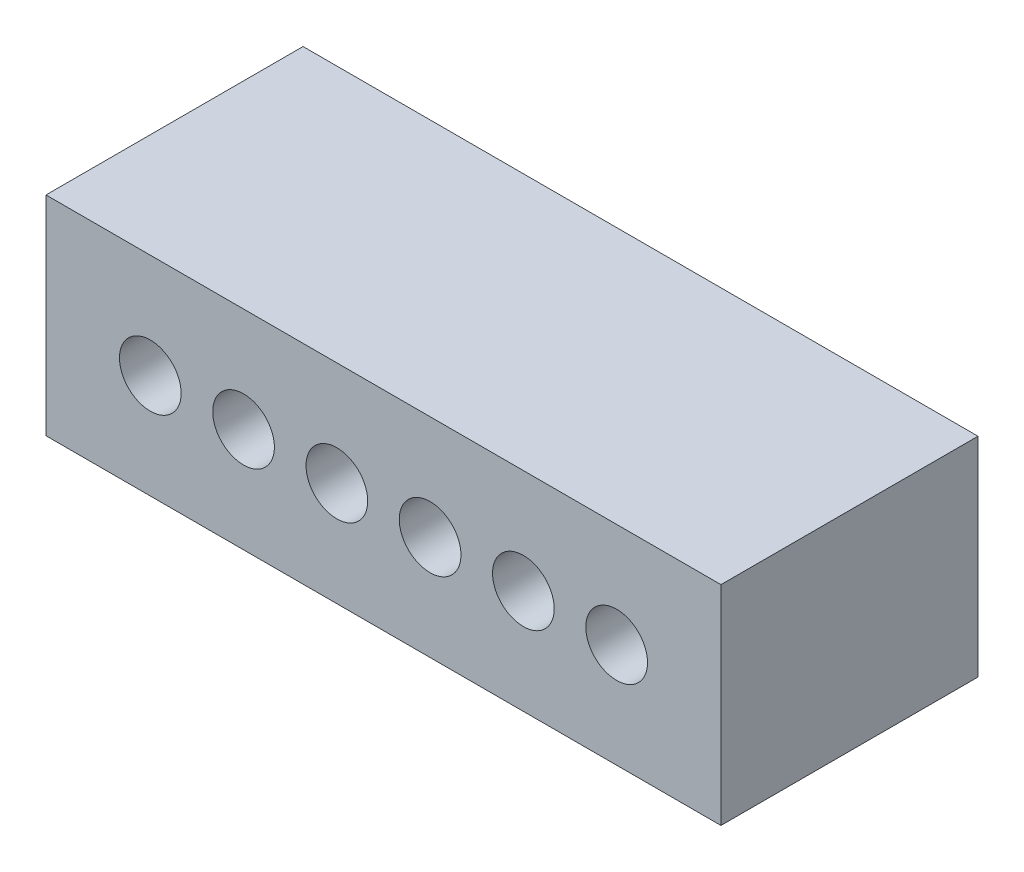
ISO-10303-21;
HEADER;
FILE_DESCRIPTION(('STEP AP214'),'2;1');
FILE_NAME('part.step','',(''),(''),'','','');
FILE_SCHEMA(('AUTOMOTIVE_DESIGN { 1 0 10303 214 1 1 1 1 }'));
ENDSEC;
DATA;
#1=APPLICATION_CONTEXT('core data for automotive mechanical design processes');
#2=APPLICATION_PROTOCOL_DEFINITION('international standard','automotive_design',2000,#1);
#3=PRODUCT_CONTEXT('',#1,'mechanical');
#4=PRODUCT('Part','Part','',(#3));
#5=PRODUCT_RELATED_PRODUCT_CATEGORY('part','',(#4));
#6=PRODUCT_DEFINITION_FORMATION('','',#4);
#7=PRODUCT_DEFINITION_CONTEXT('part definition',#1,'design');
#8=PRODUCT_DEFINITION('design','',#6,#7);
#9=PRODUCT_DEFINITION_SHAPE('','',#8);
#10=(LENGTH_UNIT() NAMED_UNIT(*) SI_UNIT(.MILLI.,.METRE.));
#11=(NAMED_UNIT(*) PLANE_ANGLE_UNIT() SI_UNIT($,.RADIAN.));
#12=(NAMED_UNIT(*) SI_UNIT($,.STERADIAN.) SOLID_ANGLE_UNIT());
#13=UNCERTAINTY_MEASURE_WITH_UNIT(LENGTH_MEASURE(1.E-05),#10,'distance_accuracy_value','');
#14=(GEOMETRIC_REPRESENTATION_CONTEXT(3) GLOBAL_UNCERTAINTY_ASSIGNED_CONTEXT((#13)) GLOBAL_UNIT_ASSIGNED_CONTEXT((#10,
#11,#12)) REPRESENTATION_CONTEXT('',''));
#15=CARTESIAN_POINT('',(0.,0.,0.));
#16=DIRECTION('',(0.,0.,1.));
#17=DIRECTION('',(1.,0.,0.));
#18=AXIS2_PLACEMENT_3D('',#15,#16,#17);
#19=CARTESIAN_POINT('',(0.,0.,7.));
#20=DIRECTION('',(0.,0.,-1.));
#21=DIRECTION('',(-1.,0.,0.));
#22=AXIS2_PLACEMENT_3D('',#19,#20,#21);
#23=PLANE('',#22);
#24=DIRECTION('',(0.,1.,0.));
#25=VECTOR('',#24,1.);
#26=CARTESIAN_POINT('',(9.19,-2.84,7.));
#27=LINE('',#26,#25);
#28=CARTESIAN_POINT('',(9.19,-2.84,7.));
#29=VERTEX_POINT('',#28);
#30=CARTESIAN_POINT('',(9.19,2.84,7.));
#31=VERTEX_POINT('',#30);
#32=EDGE_CURVE('E89',#29,#31,#27,.T.);
#33=ORIENTED_EDGE('',*,*,#32,.T.);
#34=DIRECTION('',(-1.,0.,0.));
#35=VECTOR('',#34,1.);
#36=CARTESIAN_POINT('',(-9.19,2.84,7.));
#37=LINE('',#36,#35);
#38=CARTESIAN_POINT('',(-9.19,2.84,7.));
#39=VERTEX_POINT('',#38);
#40=EDGE_CURVE('E84',#31,#39,#37,.T.);
#41=ORIENTED_EDGE('',*,*,#40,.T.);
#42=DIRECTION('',(0.,-1.,0.));
#43=VECTOR('',#42,1.);
#44=CARTESIAN_POINT('',(-9.19,-2.84,7.));
#45=LINE('',#44,#43);
#46=CARTESIAN_POINT('',(-9.19,-2.84,7.));
#47=VERTEX_POINT('',#46);
#48=EDGE_CURVE('E87',#39,#47,#45,.T.);
#49=ORIENTED_EDGE('',*,*,#48,.T.);
#50=DIRECTION('',(1.,0.,0.));
#51=VECTOR('',#50,1.);
#52=CARTESIAN_POINT('',(-9.19,-2.84,7.));
#53=LINE('',#52,#51);
#54=EDGE_CURVE('E54',#47,#29,#53,.T.);
#55=ORIENTED_EDGE('',*,*,#54,.T.);
#56=EDGE_LOOP('',(#33,#41,#49,#55));
#57=FACE_BOUND('',#56,.T.);
#58=CARTESIAN_POINT('',(-6.35,0.,7.));
#59=DIRECTION('',(0.,0.,1.));
#60=DIRECTION('',(1.,0.,0.));
#61=AXIS2_PLACEMENT_3D('',#58,#59,#60);
#62=CIRCLE('',#61,0.84);
#63=CARTESIAN_POINT('',(-5.51,0.,7.));
#64=VERTEX_POINT('',#63);
#65=EDGE_CURVE('E104',#64,#64,#62,.T.);
#66=ORIENTED_EDGE('',*,*,#65,.F.);
#67=EDGE_LOOP('',(#66));
#68=FACE_BOUND('',#67,.T.);
#69=CARTESIAN_POINT('',(-3.81,0.,7.));
#70=DIRECTION('',(0.,0.,1.));
#71=DIRECTION('',(1.,0.,0.));
#72=AXIS2_PLACEMENT_3D('',#69,#70,#71);
#73=CIRCLE('',#72,0.84);
#74=CARTESIAN_POINT('',(-2.97,0.,7.));
#75=VERTEX_POINT('',#74);
#76=EDGE_CURVE('E119',#75,#75,#73,.T.);
#77=ORIENTED_EDGE('',*,*,#76,.F.);
#78=EDGE_LOOP('',(#77));
#79=FACE_BOUND('',#78,.T.);
#80=CARTESIAN_POINT('',(-1.27,0.,7.));
#81=DIRECTION('',(0.,0.,1.));
#82=DIRECTION('',(1.,0.,0.));
#83=AXIS2_PLACEMENT_3D('',#80,#81,#82);
#84=CIRCLE('',#83,0.84);
#85=CARTESIAN_POINT('',(-0.43,0.,7.));
#86=VERTEX_POINT('',#85);
#87=EDGE_CURVE('E125',#86,#86,#84,.T.);
#88=ORIENTED_EDGE('',*,*,#87,.F.);
#89=EDGE_LOOP('',(#88));
#90=FACE_BOUND('',#89,.T.);
#91=CARTESIAN_POINT('',(1.27,0.,7.));
#92=DIRECTION('',(0.,0.,1.));
#93=DIRECTION('',(1.,0.,0.));
#94=AXIS2_PLACEMENT_3D('',#91,#92,#93);
#95=CIRCLE('',#94,0.84);
#96=CARTESIAN_POINT('',(2.11,0.,7.));
#97=VERTEX_POINT('',#96);
#98=EDGE_CURVE('E131',#97,#97,#95,.T.);
#99=ORIENTED_EDGE('',*,*,#98,.F.);
#100=EDGE_LOOP('',(#99));
#101=FACE_BOUND('',#100,.T.);
#102=CARTESIAN_POINT('',(3.81,0.,7.));
#103=DIRECTION('',(0.,0.,1.));
#104=DIRECTION('',(1.,0.,0.));
#105=AXIS2_PLACEMENT_3D('',#102,#103,#104);
#106=CIRCLE('',#105,0.84);
#107=CARTESIAN_POINT('',(4.65,0.,7.));
#108=VERTEX_POINT('',#107);
#109=EDGE_CURVE('E137',#108,#108,#106,.T.);
#110=ORIENTED_EDGE('',*,*,#109,.F.);
#111=EDGE_LOOP('',(#110));
#112=FACE_BOUND('',#111,.T.);
#113=CARTESIAN_POINT('',(6.35,0.,7.));
#114=DIRECTION('',(0.,0.,1.));
#115=DIRECTION('',(1.,0.,0.));
#116=AXIS2_PLACEMENT_3D('',#113,#114,#115);
#117=CIRCLE('',#116,0.84);
#118=CARTESIAN_POINT('',(7.19,0.,7.));
#119=VERTEX_POINT('',#118);
#120=EDGE_CURVE('E143',#119,#119,#117,.T.);
#121=ORIENTED_EDGE('',*,*,#120,.F.);
#122=EDGE_LOOP('',(#121));
#123=FACE_BOUND('',#122,.T.);
#124=ADVANCED_FACE('F37',(#57,#68,#79,#90,#101,#112,#123),#23,.F.);
#125=CARTESIAN_POINT('',(0.,0.,0.));
#126=DIRECTION('',(0.,0.,-1.));
#127=DIRECTION('',(-1.,0.,0.));
#128=AXIS2_PLACEMENT_3D('',#125,#126,#127);
#129=PLANE('',#128);
#130=CARTESIAN_POINT('',(3.81,0.,0.));
#131=DIRECTION('',(0.,0.,1.));
#132=DIRECTION('',(1.,0.,0.));
#133=AXIS2_PLACEMENT_3D('',#130,#131,#132);
#134=CIRCLE('',#133,0.84);
#135=CARTESIAN_POINT('',(4.65,0.,0.));
#136=VERTEX_POINT('',#135);
#137=EDGE_CURVE('E140',#136,#136,#134,.T.);
#138=ORIENTED_EDGE('',*,*,#137,.T.);
#139=EDGE_LOOP('',(#138));
#140=FACE_BOUND('',#139,.T.);
#141=CARTESIAN_POINT('',(-1.27,0.,0.));
#142=DIRECTION('',(0.,0.,1.));
#143=DIRECTION('',(1.,0.,0.));
#144=AXIS2_PLACEMENT_3D('',#141,#142,#143);
#145=CIRCLE('',#144,0.84);
#146=CARTESIAN_POINT('',(-0.43,0.,0.));
#147=VERTEX_POINT('',#146);
#148=EDGE_CURVE('E128',#147,#147,#145,.T.);
#149=ORIENTED_EDGE('',*,*,#148,.T.);
#150=EDGE_LOOP('',(#149));
#151=FACE_BOUND('',#150,.T.);
#152=CARTESIAN_POINT('',(-6.35,0.,0.));
#153=DIRECTION('',(0.,0.,1.));
#154=DIRECTION('',(1.,0.,0.));
#155=AXIS2_PLACEMENT_3D('',#152,#153,#154);
#156=CIRCLE('',#155,0.84);
#157=CARTESIAN_POINT('',(-5.51,0.,0.));
#158=VERTEX_POINT('',#157);
#159=EDGE_CURVE('E116',#158,#158,#156,.T.);
#160=ORIENTED_EDGE('',*,*,#159,.T.);
#161=EDGE_LOOP('',(#160));
#162=FACE_BOUND('',#161,.T.);
#163=DIRECTION('',(0.,1.,0.));
#164=VECTOR('',#163,1.);
#165=CARTESIAN_POINT('',(9.19,-2.84,0.));
#166=LINE('',#165,#164);
#167=CARTESIAN_POINT('',(9.19,-2.84,0.));
#168=VERTEX_POINT('',#167);
#169=CARTESIAN_POINT('',(9.19,2.84,0.));
#170=VERTEX_POINT('',#169);
#171=EDGE_CURVE('E101',#168,#170,#166,.T.);
#172=ORIENTED_EDGE('',*,*,#171,.F.);
#173=DIRECTION('',(1.,0.,0.));
#174=VECTOR('',#173,1.);
#175=CARTESIAN_POINT('',(-9.19,-2.84,0.));
#176=LINE('',#175,#174);
#177=CARTESIAN_POINT('',(-9.19,-2.84,0.));
#178=VERTEX_POINT('',#177);
#179=EDGE_CURVE('E77',#178,#168,#176,.T.);
#180=ORIENTED_EDGE('',*,*,#179,.F.);
#181=DIRECTION('',(0.,-1.,0.));
#182=VECTOR('',#181,1.);
#183=CARTESIAN_POINT('',(-9.19,-2.84,0.));
#184=LINE('',#183,#182);
#185=CARTESIAN_POINT('',(-9.19,2.84,0.));
#186=VERTEX_POINT('',#185);
#187=EDGE_CURVE('E71',#186,#178,#184,.T.);
#188=ORIENTED_EDGE('',*,*,#187,.F.);
#189=DIRECTION('',(-1.,0.,0.));
#190=VECTOR('',#189,1.);
#191=CARTESIAN_POINT('',(-9.19,2.84,0.));
#192=LINE('',#191,#190);
#193=EDGE_CURVE('E93',#170,#186,#192,.T.);
#194=ORIENTED_EDGE('',*,*,#193,.F.);
#195=EDGE_LOOP('',(#172,#180,#188,#194));
#196=FACE_BOUND('',#195,.T.);
#197=CARTESIAN_POINT('',(-3.81,0.,0.));
#198=DIRECTION('',(0.,0.,1.));
#199=DIRECTION('',(1.,0.,0.));
#200=AXIS2_PLACEMENT_3D('',#197,#198,#199);
#201=CIRCLE('',#200,0.84);
#202=CARTESIAN_POINT('',(-2.97,0.,0.));
#203=VERTEX_POINT('',#202);
#204=EDGE_CURVE('E122',#203,#203,#201,.T.);
#205=ORIENTED_EDGE('',*,*,#204,.T.);
#206=EDGE_LOOP('',(#205));
#207=FACE_BOUND('',#206,.T.);
#208=CARTESIAN_POINT('',(1.27,0.,0.));
#209=DIRECTION('',(0.,0.,1.));
#210=DIRECTION('',(1.,0.,0.));
#211=AXIS2_PLACEMENT_3D('',#208,#209,#210);
#212=CIRCLE('',#211,0.84);
#213=CARTESIAN_POINT('',(2.11,0.,0.));
#214=VERTEX_POINT('',#213);
#215=EDGE_CURVE('E134',#214,#214,#212,.T.);
#216=ORIENTED_EDGE('',*,*,#215,.T.);
#217=EDGE_LOOP('',(#216));
#218=FACE_BOUND('',#217,.T.);
#219=CARTESIAN_POINT('',(6.35,0.,0.));
#220=DIRECTION('',(0.,0.,1.));
#221=DIRECTION('',(1.,0.,0.));
#222=AXIS2_PLACEMENT_3D('',#219,#220,#221);
#223=CIRCLE('',#222,0.84);
#224=CARTESIAN_POINT('',(7.19,0.,0.));
#225=VERTEX_POINT('',#224);
#226=EDGE_CURVE('E146',#225,#225,#223,.T.);
#227=ORIENTED_EDGE('',*,*,#226,.T.);
#228=EDGE_LOOP('',(#227));
#229=FACE_BOUND('',#228,.T.);
#230=ADVANCED_FACE('F112',(#140,#151,#162,#196,#207,#218,#229),#129,.T.);
#231=CARTESIAN_POINT('',(9.19,-2.84,7.));
#232=DIRECTION('',(-1.,0.,0.));
#233=DIRECTION('',(0.,0.,1.));
#234=AXIS2_PLACEMENT_3D('',#231,#232,#233);
#235=PLANE('',#234);
#236=ORIENTED_EDGE('',*,*,#171,.T.);
#237=DIRECTION('',(0.,0.,-1.));
#238=VECTOR('',#237,1.);
#239=CARTESIAN_POINT('',(9.19,2.84,7.));
#240=LINE('',#239,#238);
#241=EDGE_CURVE('E11',#31,#170,#240,.T.);
#242=ORIENTED_EDGE('',*,*,#241,.F.);
#243=ORIENTED_EDGE('',*,*,#32,.F.);
#244=DIRECTION('',(0.,0.,-1.));
#245=VECTOR('',#244,1.);
#246=CARTESIAN_POINT('',(9.19,-2.84,7.));
#247=LINE('',#246,#245);
#248=EDGE_CURVE('E97',#29,#168,#247,.T.);
#249=ORIENTED_EDGE('',*,*,#248,.T.);
#250=EDGE_LOOP('',(#236,#242,#243,#249));
#251=FACE_BOUND('',#250,.T.);
#252=ADVANCED_FACE('F39',(#251),#235,.F.);
#253=CARTESIAN_POINT('',(-9.19,2.84,7.));
#254=DIRECTION('',(0.,-1.,0.));
#255=DIRECTION('',(0.,0.,-1.));
#256=AXIS2_PLACEMENT_3D('',#253,#254,#255);
#257=PLANE('',#256);
#258=ORIENTED_EDGE('',*,*,#193,.T.);
#259=DIRECTION('',(0.,0.,-1.));
#260=VECTOR('',#259,1.);
#261=CARTESIAN_POINT('',(-9.19,2.84,7.));
#262=LINE('',#261,#260);
#263=EDGE_CURVE('E46',#39,#186,#262,.T.);
#264=ORIENTED_EDGE('',*,*,#263,.F.);
#265=ORIENTED_EDGE('',*,*,#40,.F.);
#266=ORIENTED_EDGE('',*,*,#241,.T.);
#267=EDGE_LOOP('',(#258,#264,#265,#266));
#268=FACE_BOUND('',#267,.T.);
#269=ADVANCED_FACE('F92',(#268),#257,.F.);
#270=CARTESIAN_POINT('',(-9.19,-2.84,7.));
#271=DIRECTION('',(1.,0.,0.));
#272=DIRECTION('',(0.,0.,-1.));
#273=AXIS2_PLACEMENT_3D('',#270,#271,#272);
#274=PLANE('',#273);
#275=ORIENTED_EDGE('',*,*,#187,.T.);
#276=DIRECTION('',(0.,0.,-1.));
#277=VECTOR('',#276,1.);
#278=CARTESIAN_POINT('',(-9.19,-2.84,7.));
#279=LINE('',#278,#277);
#280=EDGE_CURVE('E94',#47,#178,#279,.T.);
#281=ORIENTED_EDGE('',*,*,#280,.F.);
#282=ORIENTED_EDGE('',*,*,#48,.F.);
#283=ORIENTED_EDGE('',*,*,#263,.T.);
#284=EDGE_LOOP('',(#275,#281,#282,#283));
#285=FACE_BOUND('',#284,.T.);
#286=ADVANCED_FACE('F95',(#285),#274,.F.);
#287=CARTESIAN_POINT('',(-9.19,-2.84,7.));
#288=DIRECTION('',(0.,1.,0.));
#289=DIRECTION('',(0.,0.,1.));
#290=AXIS2_PLACEMENT_3D('',#287,#288,#289);
#291=PLANE('',#290);
#292=ORIENTED_EDGE('',*,*,#179,.T.);
#293=ORIENTED_EDGE('',*,*,#248,.F.);
#294=ORIENTED_EDGE('',*,*,#54,.F.);
#295=ORIENTED_EDGE('',*,*,#280,.T.);
#296=EDGE_LOOP('',(#292,#293,#294,#295));
#297=FACE_BOUND('',#296,.T.);
#298=ADVANCED_FACE('F109',(#297),#291,.F.);
#299=CARTESIAN_POINT('',(-6.35,0.,7.));
#300=DIRECTION('',(0.,0.,-1.));
#301=DIRECTION('',(-1.,0.,0.));
#302=AXIS2_PLACEMENT_3D('',#299,#300,#301);
#303=CYLINDRICAL_SURFACE('',#302,0.84);
#304=ORIENTED_EDGE('',*,*,#65,.T.);
#305=EDGE_LOOP('',(#304));
#306=FACE_BOUND('',#305,.T.);
#307=ORIENTED_EDGE('',*,*,#159,.F.);
#308=EDGE_LOOP('',(#307));
#309=FACE_BOUND('',#308,.T.);
#310=ADVANCED_FACE('F163',(#306,#309),#303,.F.);
#311=CARTESIAN_POINT('',(-3.81,0.,7.));
#312=DIRECTION('',(0.,0.,-1.));
#313=DIRECTION('',(-1.,0.,0.));
#314=AXIS2_PLACEMENT_3D('',#311,#312,#313);
#315=CYLINDRICAL_SURFACE('',#314,0.84);
#316=ORIENTED_EDGE('',*,*,#76,.T.);
#317=EDGE_LOOP('',(#316));
#318=FACE_BOUND('',#317,.T.);
#319=ORIENTED_EDGE('',*,*,#204,.F.);
#320=EDGE_LOOP('',(#319));
#321=FACE_BOUND('',#320,.T.);
#322=ADVANCED_FACE('F217',(#318,#321),#315,.F.);
#323=CARTESIAN_POINT('',(-1.27,0.,7.));
#324=DIRECTION('',(0.,0.,-1.));
#325=DIRECTION('',(-1.,0.,0.));
#326=AXIS2_PLACEMENT_3D('',#323,#324,#325);
#327=CYLINDRICAL_SURFACE('',#326,0.84);
#328=ORIENTED_EDGE('',*,*,#87,.T.);
#329=EDGE_LOOP('',(#328));
#330=FACE_BOUND('',#329,.T.);
#331=ORIENTED_EDGE('',*,*,#148,.F.);
#332=EDGE_LOOP('',(#331));
#333=FACE_BOUND('',#332,.T.);
#334=ADVANCED_FACE('F226',(#330,#333),#327,.F.);
#335=CARTESIAN_POINT('',(1.27,0.,7.));
#336=DIRECTION('',(0.,0.,-1.));
#337=DIRECTION('',(-1.,0.,0.));
#338=AXIS2_PLACEMENT_3D('',#335,#336,#337);
#339=CYLINDRICAL_SURFACE('',#338,0.84);
#340=ORIENTED_EDGE('',*,*,#98,.T.);
#341=EDGE_LOOP('',(#340));
#342=FACE_BOUND('',#341,.T.);
#343=ORIENTED_EDGE('',*,*,#215,.F.);
#344=EDGE_LOOP('',(#343));
#345=FACE_BOUND('',#344,.T.);
#346=ADVANCED_FACE('F235',(#342,#345),#339,.F.);
#347=CARTESIAN_POINT('',(3.81,0.,7.));
#348=DIRECTION('',(0.,0.,-1.));
#349=DIRECTION('',(-1.,0.,0.));
#350=AXIS2_PLACEMENT_3D('',#347,#348,#349);
#351=CYLINDRICAL_SURFACE('',#350,0.84);
#352=ORIENTED_EDGE('',*,*,#109,.T.);
#353=EDGE_LOOP('',(#352));
#354=FACE_BOUND('',#353,.T.);
#355=ORIENTED_EDGE('',*,*,#137,.F.);
#356=EDGE_LOOP('',(#355));
#357=FACE_BOUND('',#356,.T.);
#358=ADVANCED_FACE('F245',(#354,#357),#351,.F.);
#359=CARTESIAN_POINT('',(6.35,0.,7.));
#360=DIRECTION('',(0.,0.,-1.));
#361=DIRECTION('',(-1.,0.,0.));
#362=AXIS2_PLACEMENT_3D('',#359,#360,#361);
#363=CYLINDRICAL_SURFACE('',#362,0.84);
#364=ORIENTED_EDGE('',*,*,#120,.T.);
#365=EDGE_LOOP('',(#364));
#366=FACE_BOUND('',#365,.T.);
#367=ORIENTED_EDGE('',*,*,#226,.F.);
#368=EDGE_LOOP('',(#367));
#369=FACE_BOUND('',#368,.T.);
#370=ADVANCED_FACE('F152',(#366,#369),#363,.F.);
#371=CLOSED_SHELL('',(#124,#230,#252,#269,#286,#298,#310,#322,#334,#346,#358,#370));
#372=MANIFOLD_SOLID_BREP('B2',#371);
#373=ADVANCED_BREP_SHAPE_REPRESENTATION('',(#18,#372),#14);
#374=SHAPE_DEFINITION_REPRESENTATION(#9,#373);
ENDSEC;
END-ISO-10303-21;
